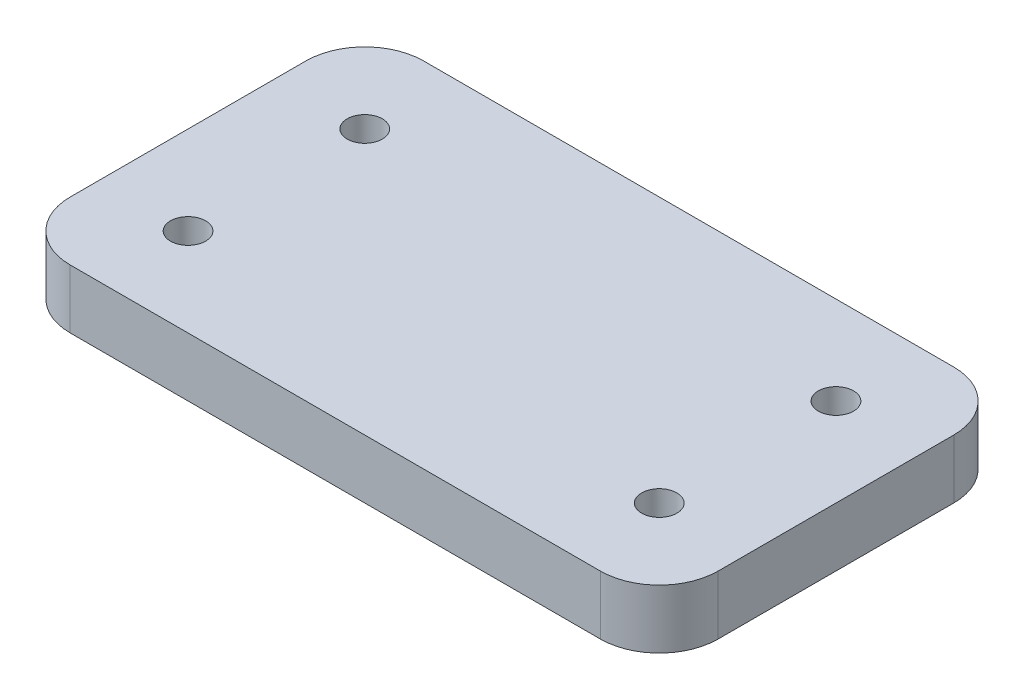
ISO-10303-21;
HEADER;
FILE_DESCRIPTION(('STEP AP214'),'2;1');
FILE_NAME('part.step','',(''),(''),'','','');
FILE_SCHEMA(('AUTOMOTIVE_DESIGN { 1 0 10303 214 1 1 1 1 }'));
ENDSEC;
DATA;
#1=APPLICATION_CONTEXT('core data for automotive mechanical design processes');
#2=APPLICATION_PROTOCOL_DEFINITION('international standard','automotive_design',2000,#1);
#3=PRODUCT_CONTEXT('',#1,'mechanical');
#4=PRODUCT('Part','Part','',(#3));
#5=PRODUCT_RELATED_PRODUCT_CATEGORY('part','',(#4));
#6=PRODUCT_DEFINITION_FORMATION('','',#4);
#7=PRODUCT_DEFINITION_CONTEXT('part definition',#1,'design');
#8=PRODUCT_DEFINITION('design','',#6,#7);
#9=PRODUCT_DEFINITION_SHAPE('','',#8);
#10=(LENGTH_UNIT() NAMED_UNIT(*) SI_UNIT(.MILLI.,.METRE.));
#11=(NAMED_UNIT(*) PLANE_ANGLE_UNIT() SI_UNIT($,.RADIAN.));
#12=(NAMED_UNIT(*) SI_UNIT($,.STERADIAN.) SOLID_ANGLE_UNIT());
#13=UNCERTAINTY_MEASURE_WITH_UNIT(LENGTH_MEASURE(1.E-05),#10,'distance_accuracy_value','');
#14=(GEOMETRIC_REPRESENTATION_CONTEXT(3) GLOBAL_UNCERTAINTY_ASSIGNED_CONTEXT((#13)) GLOBAL_UNIT_ASSIGNED_CONTEXT((#10,
#11,#12)) REPRESENTATION_CONTEXT('',''));
#15=CARTESIAN_POINT('',(0.,0.,0.));
#16=DIRECTION('',(0.,0.,1.));
#17=DIRECTION('',(1.,0.,0.));
#18=AXIS2_PLACEMENT_3D('',#15,#16,#17);
#19=CARTESIAN_POINT('',(-34.925,6.35,-19.05));
#20=DIRECTION('',(1.,0.,0.));
#21=DIRECTION('',(0.,0.,-1.));
#22=AXIS2_PLACEMENT_3D('',#19,#20,#21);
#23=PLANE('',#22);
#24=DIRECTION('',(0.,0.,1.));
#25=VECTOR('',#24,1.);
#26=CARTESIAN_POINT('',(-34.925,6.35,-19.05));
#27=LINE('',#26,#25);
#28=CARTESIAN_POINT('',(-34.925,6.35,-12.7));
#29=VERTEX_POINT('',#28);
#30=CARTESIAN_POINT('',(-34.925,6.35,12.7));
#31=VERTEX_POINT('',#30);
#32=EDGE_CURVE('E117',#29,#31,#27,.T.);
#33=ORIENTED_EDGE('',*,*,#32,.F.);
#34=DIRECTION('',(0.,-1.,0.));
#35=VECTOR('',#34,1.);
#36=CARTESIAN_POINT('',(-34.925,6.35,-12.7));
#37=LINE('',#36,#35);
#38=CARTESIAN_POINT('',(-34.925,0.,-12.7));
#39=VERTEX_POINT('',#38);
#40=EDGE_CURVE('E102',#29,#39,#37,.T.);
#41=ORIENTED_EDGE('',*,*,#40,.T.);
#42=DIRECTION('',(0.,0.,1.));
#43=VECTOR('',#42,1.);
#44=CARTESIAN_POINT('',(-34.925,0.,-19.05));
#45=LINE('',#44,#43);
#46=CARTESIAN_POINT('',(-34.925,0.,12.7));
#47=VERTEX_POINT('',#46);
#48=EDGE_CURVE('E114',#39,#47,#45,.T.);
#49=ORIENTED_EDGE('',*,*,#48,.T.);
#50=DIRECTION('',(0.,-1.,0.));
#51=VECTOR('',#50,1.);
#52=CARTESIAN_POINT('',(-34.925,6.35,12.7));
#53=LINE('',#52,#51);
#54=EDGE_CURVE('E119',#47,#31,#53,.F.);
#55=ORIENTED_EDGE('',*,*,#54,.T.);
#56=EDGE_LOOP('',(#33,#41,#49,#55));
#57=FACE_BOUND('',#56,.T.);
#58=ADVANCED_FACE('F32',(#57),#23,.F.);
#59=CARTESIAN_POINT('',(34.925,6.35,19.05));
#60=DIRECTION('',(0.,0.,-1.));
#61=DIRECTION('',(-1.,0.,0.));
#62=AXIS2_PLACEMENT_3D('',#59,#60,#61);
#63=PLANE('',#62);
#64=DIRECTION('',(1.,0.,0.));
#65=VECTOR('',#64,1.);
#66=CARTESIAN_POINT('',(34.925,6.35,19.05));
#67=LINE('',#66,#65);
#68=CARTESIAN_POINT('',(-28.575,6.35,19.05));
#69=VERTEX_POINT('',#68);
#70=CARTESIAN_POINT('',(28.575,6.35,19.05));
#71=VERTEX_POINT('',#70);
#72=EDGE_CURVE('E163',#69,#71,#67,.T.);
#73=ORIENTED_EDGE('',*,*,#72,.F.);
#74=DIRECTION('',(0.,-1.,0.));
#75=VECTOR('',#74,1.);
#76=CARTESIAN_POINT('',(-28.575,6.35,19.05));
#77=LINE('',#76,#75);
#78=CARTESIAN_POINT('',(-28.575,0.,19.05));
#79=VERTEX_POINT('',#78);
#80=EDGE_CURVE('E156',#69,#79,#77,.T.);
#81=ORIENTED_EDGE('',*,*,#80,.T.);
#82=DIRECTION('',(1.,0.,0.));
#83=VECTOR('',#82,1.);
#84=CARTESIAN_POINT('',(34.925,0.,19.05));
#85=LINE('',#84,#83);
#86=CARTESIAN_POINT('',(28.575,0.,19.05));
#87=VERTEX_POINT('',#86);
#88=EDGE_CURVE('E123',#79,#87,#85,.T.);
#89=ORIENTED_EDGE('',*,*,#88,.T.);
#90=DIRECTION('',(0.,-1.,0.));
#91=VECTOR('',#90,1.);
#92=CARTESIAN_POINT('',(28.575,6.35,19.05));
#93=LINE('',#92,#91);
#94=EDGE_CURVE('E154',#87,#71,#93,.F.);
#95=ORIENTED_EDGE('',*,*,#94,.T.);
#96=EDGE_LOOP('',(#73,#81,#89,#95));
#97=FACE_BOUND('',#96,.T.);
#98=ADVANCED_FACE('F161',(#97),#63,.F.);
#99=CARTESIAN_POINT('',(34.925,6.35,-19.05));
#100=DIRECTION('',(-1.,0.,0.));
#101=DIRECTION('',(0.,0.,1.));
#102=AXIS2_PLACEMENT_3D('',#99,#100,#101);
#103=PLANE('',#102);
#104=DIRECTION('',(0.,0.,-1.));
#105=VECTOR('',#104,1.);
#106=CARTESIAN_POINT('',(34.925,6.35,-19.05));
#107=LINE('',#106,#105);
#108=CARTESIAN_POINT('',(34.925,6.35,12.7));
#109=VERTEX_POINT('',#108);
#110=CARTESIAN_POINT('',(34.925,6.35,-12.7));
#111=VERTEX_POINT('',#110);
#112=EDGE_CURVE('E171',#109,#111,#107,.T.);
#113=ORIENTED_EDGE('',*,*,#112,.F.);
#114=DIRECTION('',(0.,-1.,0.));
#115=VECTOR('',#114,1.);
#116=CARTESIAN_POINT('',(34.925,6.35,12.7));
#117=LINE('',#116,#115);
#118=CARTESIAN_POINT('',(34.925,0.,12.7));
#119=VERTEX_POINT('',#118);
#120=EDGE_CURVE('E11',#109,#119,#117,.T.);
#121=ORIENTED_EDGE('',*,*,#120,.T.);
#122=DIRECTION('',(0.,0.,-1.));
#123=VECTOR('',#122,1.);
#124=CARTESIAN_POINT('',(34.925,0.,-19.05));
#125=LINE('',#124,#123);
#126=CARTESIAN_POINT('',(34.925,0.,-12.7));
#127=VERTEX_POINT('',#126);
#128=EDGE_CURVE('E127',#119,#127,#125,.T.);
#129=ORIENTED_EDGE('',*,*,#128,.T.);
#130=DIRECTION('',(0.,-1.,0.));
#131=VECTOR('',#130,1.);
#132=CARTESIAN_POINT('',(34.925,6.35,-12.7));
#133=LINE('',#132,#131);
#134=EDGE_CURVE('E40',#127,#111,#133,.F.);
#135=ORIENTED_EDGE('',*,*,#134,.T.);
#136=EDGE_LOOP('',(#113,#121,#129,#135));
#137=FACE_BOUND('',#136,.T.);
#138=ADVANCED_FACE('F170',(#137),#103,.F.);
#139=CARTESIAN_POINT('',(34.925,6.35,-19.05));
#140=DIRECTION('',(0.,0.,1.));
#141=DIRECTION('',(1.,0.,0.));
#142=AXIS2_PLACEMENT_3D('',#139,#140,#141);
#143=PLANE('',#142);
#144=DIRECTION('',(-1.,0.,0.));
#145=VECTOR('',#144,1.);
#146=CARTESIAN_POINT('',(34.925,0.,-19.05));
#147=LINE('',#146,#145);
#148=CARTESIAN_POINT('',(28.575,0.,-19.05));
#149=VERTEX_POINT('',#148);
#150=CARTESIAN_POINT('',(-28.575,0.,-19.05));
#151=VERTEX_POINT('',#150);
#152=EDGE_CURVE('E137',#149,#151,#147,.T.);
#153=ORIENTED_EDGE('',*,*,#152,.T.);
#154=DIRECTION('',(0.,-1.,0.));
#155=VECTOR('',#154,1.);
#156=CARTESIAN_POINT('',(-28.575,6.35,-19.05));
#157=LINE('',#156,#155);
#158=CARTESIAN_POINT('',(-28.575,6.35,-19.05));
#159=VERTEX_POINT('',#158);
#160=EDGE_CURVE('E103',#151,#159,#157,.F.);
#161=ORIENTED_EDGE('',*,*,#160,.T.);
#162=DIRECTION('',(-1.,0.,0.));
#163=VECTOR('',#162,1.);
#164=CARTESIAN_POINT('',(34.925,6.35,-19.05));
#165=LINE('',#164,#163);
#166=CARTESIAN_POINT('',(28.575,6.35,-19.05));
#167=VERTEX_POINT('',#166);
#168=EDGE_CURVE('E133',#167,#159,#165,.T.);
#169=ORIENTED_EDGE('',*,*,#168,.F.);
#170=DIRECTION('',(0.,-1.,0.));
#171=VECTOR('',#170,1.);
#172=CARTESIAN_POINT('',(28.575,6.35,-19.05));
#173=LINE('',#172,#171);
#174=EDGE_CURVE('E108',#167,#149,#173,.T.);
#175=ORIENTED_EDGE('',*,*,#174,.T.);
#176=EDGE_LOOP('',(#153,#161,#169,#175));
#177=FACE_BOUND('',#176,.T.);
#178=ADVANCED_FACE('F219',(#177),#143,.F.);
#179=CARTESIAN_POINT('',(-34.925,6.35,19.05));
#180=DIRECTION('',(0.,-1.,0.));
#181=DIRECTION('',(0.,0.,-1.));
#182=AXIS2_PLACEMENT_3D('',#179,#180,#181);
#183=PLANE('',#182);
#184=CARTESIAN_POINT('',(-25.4,6.35,9.525));
#185=DIRECTION('',(0.,-1.,0.));
#186=DIRECTION('',(0.,0.,-1.));
#187=AXIS2_PLACEMENT_3D('',#184,#185,#186);
#188=CIRCLE('',#187,1.89864999999999);
#189=CARTESIAN_POINT('',(-25.4,6.35,7.62635000000001));
#190=VERTEX_POINT('',#189);
#191=EDGE_CURVE('E191',#190,#190,#188,.T.);
#192=ORIENTED_EDGE('',*,*,#191,.T.);
#193=EDGE_LOOP('',(#192));
#194=FACE_BOUND('',#193,.T.);
#195=CARTESIAN_POINT('',(25.4,6.35,-9.52500000000001));
#196=DIRECTION('',(0.,-1.,0.));
#197=DIRECTION('',(0.,0.,-1.));
#198=AXIS2_PLACEMENT_3D('',#195,#196,#197);
#199=CIRCLE('',#198,1.89864999999999);
#200=CARTESIAN_POINT('',(25.4,6.35,-11.42365));
#201=VERTEX_POINT('',#200);
#202=EDGE_CURVE('E185',#201,#201,#199,.T.);
#203=ORIENTED_EDGE('',*,*,#202,.T.);
#204=EDGE_LOOP('',(#203));
#205=FACE_BOUND('',#204,.T.);
#206=CARTESIAN_POINT('',(-25.4,6.35,-9.525));
#207=DIRECTION('',(0.,-1.,0.));
#208=DIRECTION('',(0.,0.,-1.));
#209=AXIS2_PLACEMENT_3D('',#206,#207,#208);
#210=CIRCLE('',#209,1.89864999999999);
#211=CARTESIAN_POINT('',(-25.4,6.35,-11.42365));
#212=VERTEX_POINT('',#211);
#213=EDGE_CURVE('E179',#212,#212,#210,.T.);
#214=ORIENTED_EDGE('',*,*,#213,.T.);
#215=EDGE_LOOP('',(#214));
#216=FACE_BOUND('',#215,.T.);
#217=CARTESIAN_POINT('',(25.4,6.35,9.525));
#218=DIRECTION('',(0.,-1.,0.));
#219=DIRECTION('',(0.,0.,-1.));
#220=AXIS2_PLACEMENT_3D('',#217,#218,#219);
#221=CIRCLE('',#220,1.89864999999999);
#222=CARTESIAN_POINT('',(25.4,6.35,7.62635000000001));
#223=VERTEX_POINT('',#222);
#224=EDGE_CURVE('E124',#223,#223,#221,.T.);
#225=ORIENTED_EDGE('',*,*,#224,.T.);
#226=EDGE_LOOP('',(#225));
#227=FACE_BOUND('',#226,.T.);
#228=ORIENTED_EDGE('',*,*,#168,.T.);
#229=CARTESIAN_POINT('',(-28.575,6.35,-12.7));
#230=DIRECTION('',(0.,-1.,0.));
#231=DIRECTION('',(0.,0.,-1.));
#232=AXIS2_PLACEMENT_3D('',#229,#230,#231);
#233=CIRCLE('',#232,6.35);
#234=EDGE_CURVE('E152',#159,#29,#233,.F.);
#235=ORIENTED_EDGE('',*,*,#234,.T.);
#236=ORIENTED_EDGE('',*,*,#32,.T.);
#237=CARTESIAN_POINT('',(-28.575,6.35,12.7));
#238=DIRECTION('',(0.,-1.,0.));
#239=DIRECTION('',(0.,0.,-1.));
#240=AXIS2_PLACEMENT_3D('',#237,#238,#239);
#241=CIRCLE('',#240,6.35);
#242=EDGE_CURVE('E150',#31,#69,#241,.F.);
#243=ORIENTED_EDGE('',*,*,#242,.T.);
#244=ORIENTED_EDGE('',*,*,#72,.T.);
#245=CARTESIAN_POINT('',(28.575,6.35,12.7));
#246=DIRECTION('',(0.,-1.,0.));
#247=DIRECTION('',(0.,0.,-1.));
#248=AXIS2_PLACEMENT_3D('',#245,#246,#247);
#249=CIRCLE('',#248,6.35);
#250=EDGE_CURVE('E53',#71,#109,#249,.F.);
#251=ORIENTED_EDGE('',*,*,#250,.T.);
#252=ORIENTED_EDGE('',*,*,#112,.T.);
#253=CARTESIAN_POINT('',(28.575,6.35,-12.7));
#254=DIRECTION('',(0.,-1.,0.));
#255=DIRECTION('',(0.,0.,-1.));
#256=AXIS2_PLACEMENT_3D('',#253,#254,#255);
#257=CIRCLE('',#256,6.35);
#258=EDGE_CURVE('E147',#111,#167,#257,.F.);
#259=ORIENTED_EDGE('',*,*,#258,.T.);
#260=EDGE_LOOP('',(#228,#235,#236,#243,#244,#251,#252,#259));
#261=FACE_BOUND('',#260,.T.);
#262=ADVANCED_FACE('F204',(#194,#205,#216,#227,#261),#183,.F.);
#263=CARTESIAN_POINT('',(-34.925,0.,19.05));
#264=DIRECTION('',(0.,-1.,0.));
#265=DIRECTION('',(0.,0.,-1.));
#266=AXIS2_PLACEMENT_3D('',#263,#264,#265);
#267=PLANE('',#266);
#268=CARTESIAN_POINT('',(-25.4,0.,9.525));
#269=DIRECTION('',(0.,-1.,0.));
#270=DIRECTION('',(0.,0.,-1.));
#271=AXIS2_PLACEMENT_3D('',#268,#269,#270);
#272=CIRCLE('',#271,1.89864999999999);
#273=CARTESIAN_POINT('',(-25.4,0.,7.62635000000001));
#274=VERTEX_POINT('',#273);
#275=EDGE_CURVE('E194',#274,#274,#272,.T.);
#276=ORIENTED_EDGE('',*,*,#275,.F.);
#277=EDGE_LOOP('',(#276));
#278=FACE_BOUND('',#277,.T.);
#279=CARTESIAN_POINT('',(25.4,0.,-9.52500000000001));
#280=DIRECTION('',(0.,-1.,0.));
#281=DIRECTION('',(0.,0.,-1.));
#282=AXIS2_PLACEMENT_3D('',#279,#280,#281);
#283=CIRCLE('',#282,1.89864999999999);
#284=CARTESIAN_POINT('',(25.4,0.,-11.42365));
#285=VERTEX_POINT('',#284);
#286=EDGE_CURVE('E188',#285,#285,#283,.T.);
#287=ORIENTED_EDGE('',*,*,#286,.F.);
#288=EDGE_LOOP('',(#287));
#289=FACE_BOUND('',#288,.T.);
#290=CARTESIAN_POINT('',(-25.4,0.,-9.525));
#291=DIRECTION('',(0.,-1.,0.));
#292=DIRECTION('',(0.,0.,-1.));
#293=AXIS2_PLACEMENT_3D('',#290,#291,#292);
#294=CIRCLE('',#293,1.89864999999999);
#295=CARTESIAN_POINT('',(-25.4,0.,-11.42365));
#296=VERTEX_POINT('',#295);
#297=EDGE_CURVE('E182',#296,#296,#294,.T.);
#298=ORIENTED_EDGE('',*,*,#297,.F.);
#299=EDGE_LOOP('',(#298));
#300=FACE_BOUND('',#299,.T.);
#301=CARTESIAN_POINT('',(25.4,0.,9.525));
#302=DIRECTION('',(0.,-1.,0.));
#303=DIRECTION('',(0.,0.,-1.));
#304=AXIS2_PLACEMENT_3D('',#301,#302,#303);
#305=CIRCLE('',#304,1.89864999999999);
#306=CARTESIAN_POINT('',(25.4,0.,7.62635000000001));
#307=VERTEX_POINT('',#306);
#308=EDGE_CURVE('E130',#307,#307,#305,.T.);
#309=ORIENTED_EDGE('',*,*,#308,.F.);
#310=EDGE_LOOP('',(#309));
#311=FACE_BOUND('',#310,.T.);
#312=ORIENTED_EDGE('',*,*,#48,.F.);
#313=CARTESIAN_POINT('',(-28.575,0.,-12.7));
#314=DIRECTION('',(0.,-1.,0.));
#315=DIRECTION('',(0.,0.,-1.));
#316=AXIS2_PLACEMENT_3D('',#313,#314,#315);
#317=CIRCLE('',#316,6.35);
#318=EDGE_CURVE('E98',#39,#151,#317,.T.);
#319=ORIENTED_EDGE('',*,*,#318,.T.);
#320=ORIENTED_EDGE('',*,*,#152,.F.);
#321=CARTESIAN_POINT('',(28.575,0.,-12.7));
#322=DIRECTION('',(0.,-1.,0.));
#323=DIRECTION('',(0.,0.,-1.));
#324=AXIS2_PLACEMENT_3D('',#321,#322,#323);
#325=CIRCLE('',#324,6.35);
#326=EDGE_CURVE('E118',#149,#127,#325,.T.);
#327=ORIENTED_EDGE('',*,*,#326,.T.);
#328=ORIENTED_EDGE('',*,*,#128,.F.);
#329=CARTESIAN_POINT('',(28.575,0.,12.7));
#330=DIRECTION('',(0.,-1.,0.));
#331=DIRECTION('',(0.,0.,-1.));
#332=AXIS2_PLACEMENT_3D('',#329,#330,#331);
#333=CIRCLE('',#332,6.35);
#334=EDGE_CURVE('E141',#119,#87,#333,.T.);
#335=ORIENTED_EDGE('',*,*,#334,.T.);
#336=ORIENTED_EDGE('',*,*,#88,.F.);
#337=CARTESIAN_POINT('',(-28.575,0.,12.7));
#338=DIRECTION('',(0.,-1.,0.));
#339=DIRECTION('',(0.,0.,-1.));
#340=AXIS2_PLACEMENT_3D('',#337,#338,#339);
#341=CIRCLE('',#340,6.35);
#342=EDGE_CURVE('E109',#79,#47,#341,.T.);
#343=ORIENTED_EDGE('',*,*,#342,.T.);
#344=EDGE_LOOP('',(#312,#319,#320,#327,#328,#335,#336,#343));
#345=FACE_BOUND('',#344,.T.);
#346=ADVANCED_FACE('F121',(#278,#289,#300,#311,#345),#267,.T.);
#347=CARTESIAN_POINT('',(25.4,0.,9.525));
#348=DIRECTION('',(0.,-1.,0.));
#349=DIRECTION('',(0.,0.,-1.));
#350=AXIS2_PLACEMENT_3D('',#347,#348,#349);
#351=CYLINDRICAL_SURFACE('',#350,1.89864999999999);
#352=ORIENTED_EDGE('',*,*,#308,.T.);
#353=EDGE_LOOP('',(#352));
#354=FACE_BOUND('',#353,.T.);
#355=ORIENTED_EDGE('',*,*,#224,.F.);
#356=EDGE_LOOP('',(#355));
#357=FACE_BOUND('',#356,.T.);
#358=ADVANCED_FACE('F203',(#354,#357),#351,.F.);
#359=CARTESIAN_POINT('',(-25.4,0.,-9.525));
#360=DIRECTION('',(0.,-1.,0.));
#361=DIRECTION('',(0.,0.,-1.));
#362=AXIS2_PLACEMENT_3D('',#359,#360,#361);
#363=CYLINDRICAL_SURFACE('',#362,1.89864999999999);
#364=ORIENTED_EDGE('',*,*,#297,.T.);
#365=EDGE_LOOP('',(#364));
#366=FACE_BOUND('',#365,.T.);
#367=ORIENTED_EDGE('',*,*,#213,.F.);
#368=EDGE_LOOP('',(#367));
#369=FACE_BOUND('',#368,.T.);
#370=ADVANCED_FACE('F214',(#366,#369),#363,.F.);
#371=CARTESIAN_POINT('',(25.4,0.,-9.52500000000001));
#372=DIRECTION('',(0.,-1.,0.));
#373=DIRECTION('',(0.,0.,-1.));
#374=AXIS2_PLACEMENT_3D('',#371,#372,#373);
#375=CYLINDRICAL_SURFACE('',#374,1.89864999999999);
#376=ORIENTED_EDGE('',*,*,#286,.T.);
#377=EDGE_LOOP('',(#376));
#378=FACE_BOUND('',#377,.T.);
#379=ORIENTED_EDGE('',*,*,#202,.F.);
#380=EDGE_LOOP('',(#379));
#381=FACE_BOUND('',#380,.T.);
#382=ADVANCED_FACE('F271',(#378,#381),#375,.F.);
#383=CARTESIAN_POINT('',(-25.4,0.,9.525));
#384=DIRECTION('',(0.,-1.,0.));
#385=DIRECTION('',(0.,0.,-1.));
#386=AXIS2_PLACEMENT_3D('',#383,#384,#385);
#387=CYLINDRICAL_SURFACE('',#386,1.89864999999999);
#388=ORIENTED_EDGE('',*,*,#275,.T.);
#389=EDGE_LOOP('',(#388));
#390=FACE_BOUND('',#389,.T.);
#391=ORIENTED_EDGE('',*,*,#191,.F.);
#392=EDGE_LOOP('',(#391));
#393=FACE_BOUND('',#392,.T.);
#394=ADVANCED_FACE('F198',(#390,#393),#387,.F.);
#395=CARTESIAN_POINT('',(-28.575,6.35,-12.7));
#396=DIRECTION('',(0.,-1.,0.));
#397=DIRECTION('',(0.,0.,-1.));
#398=AXIS2_PLACEMENT_3D('',#395,#396,#397);
#399=CYLINDRICAL_SURFACE('',#398,6.35);
#400=ORIENTED_EDGE('',*,*,#234,.F.);
#401=ORIENTED_EDGE('',*,*,#160,.F.);
#402=ORIENTED_EDGE('',*,*,#318,.F.);
#403=ORIENTED_EDGE('',*,*,#40,.F.);
#404=EDGE_LOOP('',(#400,#401,#402,#403));
#405=FACE_BOUND('',#404,.T.);
#406=ADVANCED_FACE('F101',(#405),#399,.T.);
#407=CARTESIAN_POINT('',(-28.575,6.35,12.7));
#408=DIRECTION('',(0.,-1.,0.));
#409=DIRECTION('',(0.,0.,-1.));
#410=AXIS2_PLACEMENT_3D('',#407,#408,#409);
#411=CYLINDRICAL_SURFACE('',#410,6.35);
#412=ORIENTED_EDGE('',*,*,#242,.F.);
#413=ORIENTED_EDGE('',*,*,#54,.F.);
#414=ORIENTED_EDGE('',*,*,#342,.F.);
#415=ORIENTED_EDGE('',*,*,#80,.F.);
#416=EDGE_LOOP('',(#412,#413,#414,#415));
#417=FACE_BOUND('',#416,.T.);
#418=ADVANCED_FACE('F230',(#417),#411,.T.);
#419=CARTESIAN_POINT('',(28.575,6.35,12.7));
#420=DIRECTION('',(0.,-1.,0.));
#421=DIRECTION('',(0.,0.,-1.));
#422=AXIS2_PLACEMENT_3D('',#419,#420,#421);
#423=CYLINDRICAL_SURFACE('',#422,6.35);
#424=ORIENTED_EDGE('',*,*,#250,.F.);
#425=ORIENTED_EDGE('',*,*,#94,.F.);
#426=ORIENTED_EDGE('',*,*,#334,.F.);
#427=ORIENTED_EDGE('',*,*,#120,.F.);
#428=EDGE_LOOP('',(#424,#425,#426,#427));
#429=FACE_BOUND('',#428,.T.);
#430=ADVANCED_FACE('F169',(#429),#423,.T.);
#431=CARTESIAN_POINT('',(28.575,6.35,-12.7));
#432=DIRECTION('',(0.,-1.,0.));
#433=DIRECTION('',(0.,0.,-1.));
#434=AXIS2_PLACEMENT_3D('',#431,#432,#433);
#435=CYLINDRICAL_SURFACE('',#434,6.35);
#436=ORIENTED_EDGE('',*,*,#258,.F.);
#437=ORIENTED_EDGE('',*,*,#134,.F.);
#438=ORIENTED_EDGE('',*,*,#326,.F.);
#439=ORIENTED_EDGE('',*,*,#174,.F.);
#440=EDGE_LOOP('',(#436,#437,#438,#439));
#441=FACE_BOUND('',#440,.T.);
#442=ADVANCED_FACE('F34',(#441),#435,.T.);
#443=CLOSED_SHELL('',(#58,#98,#138,#178,#262,#346,#358,#370,#382,#394,#406,#418,#430,#442));
#444=MANIFOLD_SOLID_BREP('B2',#443);
#445=ADVANCED_BREP_SHAPE_REPRESENTATION('',(#18,#444),#14);
#446=SHAPE_DEFINITION_REPRESENTATION(#9,#445);
ENDSEC;
END-ISO-10303-21;
